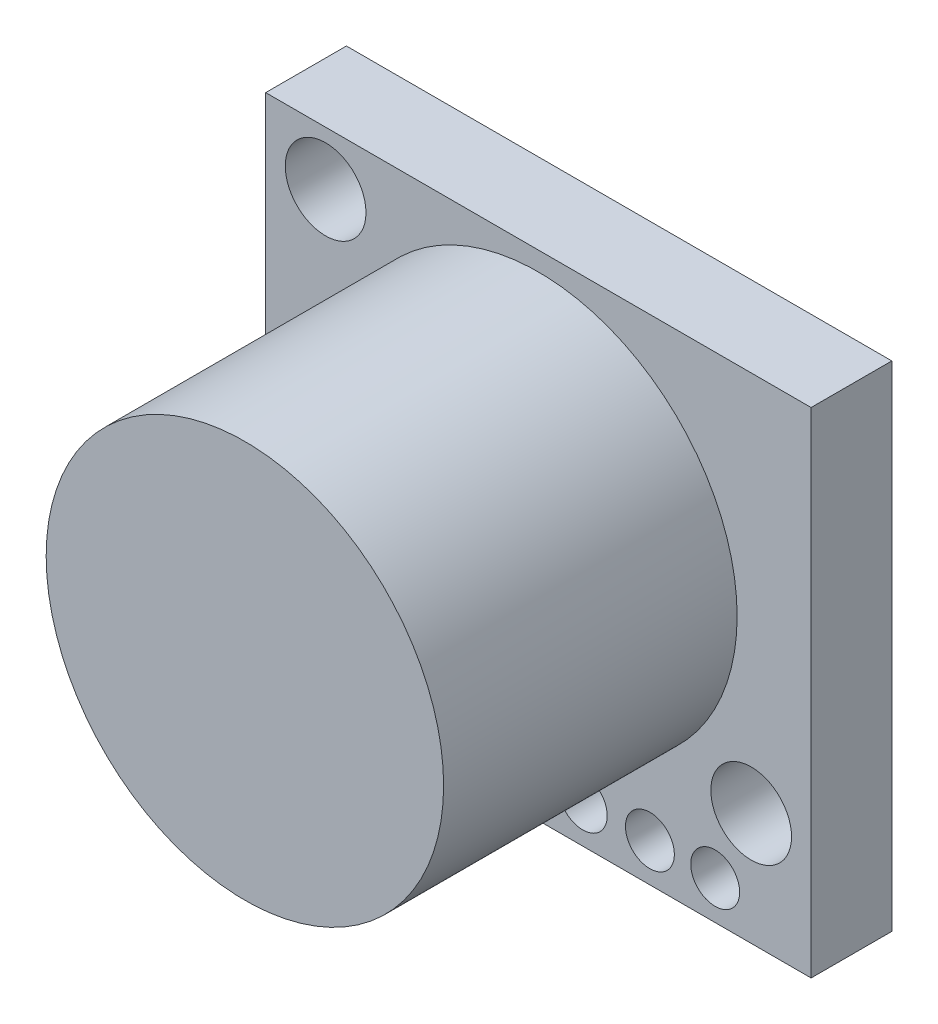
ISO-10303-21;
HEADER;
FILE_DESCRIPTION(('STEP AP214'),'2;1');
FILE_NAME('part.step','',(''),(''),'','','');
FILE_SCHEMA(('AUTOMOTIVE_DESIGN { 1 0 10303 214 1 1 1 1 }'));
ENDSEC;
DATA;
#1=APPLICATION_CONTEXT('core data for automotive mechanical design processes');
#2=APPLICATION_PROTOCOL_DEFINITION('international standard','automotive_design',2000,#1);
#3=PRODUCT_CONTEXT('',#1,'mechanical');
#4=PRODUCT('Part','Part','',(#3));
#5=PRODUCT_RELATED_PRODUCT_CATEGORY('part','',(#4));
#6=PRODUCT_DEFINITION_FORMATION('','',#4);
#7=PRODUCT_DEFINITION_CONTEXT('part definition',#1,'design');
#8=PRODUCT_DEFINITION('design','',#6,#7);
#9=PRODUCT_DEFINITION_SHAPE('','',#8);
#10=(LENGTH_UNIT() NAMED_UNIT(*) SI_UNIT(.MILLI.,.METRE.));
#11=(NAMED_UNIT(*) PLANE_ANGLE_UNIT() SI_UNIT($,.RADIAN.));
#12=(NAMED_UNIT(*) SI_UNIT($,.STERADIAN.) SOLID_ANGLE_UNIT());
#13=UNCERTAINTY_MEASURE_WITH_UNIT(LENGTH_MEASURE(1.E-05),#10,'distance_accuracy_value','');
#14=(GEOMETRIC_REPRESENTATION_CONTEXT(3) GLOBAL_UNCERTAINTY_ASSIGNED_CONTEXT((#13)) GLOBAL_UNIT_ASSIGNED_CONTEXT((#10,
#11,#12)) REPRESENTATION_CONTEXT('',''));
#15=CARTESIAN_POINT('',(0.,0.,0.));
#16=DIRECTION('',(0.,0.,1.));
#17=DIRECTION('',(1.,0.,0.));
#18=AXIS2_PLACEMENT_3D('',#15,#16,#17);
#19=CARTESIAN_POINT('',(0.,0.,3.3));
#20=DIRECTION('',(0.,0.,-1.));
#21=DIRECTION('',(-1.,0.,0.));
#22=AXIS2_PLACEMENT_3D('',#19,#20,#21);
#23=PLANE('',#22);
#24=CARTESIAN_POINT('',(4.35351159437215,1.57430663051988,3.3));
#25=DIRECTION('',(0.,0.,1.));
#26=DIRECTION('',(1.,0.,0.));
#27=AXIS2_PLACEMENT_3D('',#24,#25,#26);
#28=CIRCLE('',#27,1.);
#29=CARTESIAN_POINT('',(5.35351159437215,1.57430663051988,3.3));
#30=VERTEX_POINT('',#29);
#31=EDGE_CURVE('E119',#30,#30,#28,.T.);
#32=ORIENTED_EDGE('',*,*,#31,.F.);
#33=EDGE_LOOP('',(#32));
#34=FACE_BOUND('',#33,.T.);
#35=CARTESIAN_POINT('',(7.38027373877414,1.57430663051988,3.3));
#36=DIRECTION('',(0.,0.,1.));
#37=DIRECTION('',(1.,0.,0.));
#38=AXIS2_PLACEMENT_3D('',#35,#36,#37);
#39=CIRCLE('',#38,1.);
#40=CARTESIAN_POINT('',(8.38027373877414,1.57430663051988,3.3));
#41=VERTEX_POINT('',#40);
#42=EDGE_CURVE('E314',#41,#41,#39,.T.);
#43=ORIENTED_EDGE('',*,*,#42,.F.);
#44=EDGE_LOOP('',(#43));
#45=FACE_BOUND('',#44,.T.);
#46=CARTESIAN_POINT('',(10.2378379993276,1.57430663051988,3.3));
#47=DIRECTION('',(0.,0.,1.));
#48=DIRECTION('',(1.,0.,0.));
#49=AXIS2_PLACEMENT_3D('',#46,#47,#48);
#50=CIRCLE('',#49,1.);
#51=CARTESIAN_POINT('',(11.2378379993276,1.57430663051988,3.3));
#52=VERTEX_POINT('',#51);
#53=EDGE_CURVE('E317',#52,#52,#50,.T.);
#54=ORIENTED_EDGE('',*,*,#53,.F.);
#55=EDGE_LOOP('',(#54));
#56=FACE_BOUND('',#55,.T.);
#57=CARTESIAN_POINT('',(12.9638039057766,1.57430663051988,3.3));
#58=DIRECTION('',(0.,0.,1.));
#59=DIRECTION('',(1.,0.,0.));
#60=AXIS2_PLACEMENT_3D('',#57,#58,#59);
#61=CIRCLE('',#60,1.);
#62=CARTESIAN_POINT('',(13.9638039057766,1.57430663051988,3.3));
#63=VERTEX_POINT('',#62);
#64=EDGE_CURVE('E322',#63,#63,#61,.T.);
#65=ORIENTED_EDGE('',*,*,#64,.F.);
#66=EDGE_LOOP('',(#65));
#67=FACE_BOUND('',#66,.T.);
#68=CARTESIAN_POINT('',(15.7085695770976,1.57430663051988,3.3));
#69=DIRECTION('',(0.,0.,1.));
#70=DIRECTION('',(1.,0.,0.));
#71=AXIS2_PLACEMENT_3D('',#68,#69,#70);
#72=CIRCLE('',#71,1.);
#73=CARTESIAN_POINT('',(16.7085695770976,1.57430663051988,3.3));
#74=VERTEX_POINT('',#73);
#75=EDGE_CURVE('E324',#74,#74,#72,.T.);
#76=ORIENTED_EDGE('',*,*,#75,.F.);
#77=EDGE_LOOP('',(#76));
#78=FACE_BOUND('',#77,.T.);
#79=CARTESIAN_POINT('',(18.3781361889304,1.57430663051988,3.3));
#80=DIRECTION('',(0.,0.,1.));
#81=DIRECTION('',(1.,0.,0.));
#82=AXIS2_PLACEMENT_3D('',#79,#80,#81);
#83=CIRCLE('',#82,1.);
#84=CARTESIAN_POINT('',(19.3781361889304,1.57430663051988,3.3));
#85=VERTEX_POINT('',#84);
#86=EDGE_CURVE('E144',#85,#85,#83,.T.);
#87=ORIENTED_EDGE('',*,*,#86,.F.);
#88=EDGE_LOOP('',(#87));
#89=FACE_BOUND('',#88,.T.);
#90=CARTESIAN_POINT('',(11.15,11.3,3.3));
#91=DIRECTION('',(0.,0.,1.));
#92=DIRECTION('',(1.,0.,0.));
#93=AXIS2_PLACEMENT_3D('',#90,#91,#92);
#94=CIRCLE('',#93,8.12500000000001);
#95=CARTESIAN_POINT('',(19.275,11.3,3.3));
#96=VERTEX_POINT('',#95);
#97=EDGE_CURVE('E11',#96,#96,#94,.T.);
#98=ORIENTED_EDGE('',*,*,#97,.F.);
#99=EDGE_LOOP('',(#98));
#100=FACE_BOUND('',#99,.T.);
#101=DIRECTION('',(0.,-1.,0.));
#102=VECTOR('',#101,1.);
#103=CARTESIAN_POINT('',(0.,0.,3.3));
#104=LINE('',#103,#102);
#105=CARTESIAN_POINT('',(0.,20.2,3.3));
#106=VERTEX_POINT('',#105);
#107=CARTESIAN_POINT('',(0.,0.,3.3));
#108=VERTEX_POINT('',#107);
#109=EDGE_CURVE('E91',#106,#108,#104,.T.);
#110=ORIENTED_EDGE('',*,*,#109,.T.);
#111=DIRECTION('',(1.,0.,0.));
#112=VECTOR('',#111,1.);
#113=CARTESIAN_POINT('',(0.,0.,3.3));
#114=LINE('',#113,#112);
#115=CARTESIAN_POINT('',(22.3,0.,3.3));
#116=VERTEX_POINT('',#115);
#117=EDGE_CURVE('E86',#108,#116,#114,.T.);
#118=ORIENTED_EDGE('',*,*,#117,.T.);
#119=DIRECTION('',(0.,1.,0.));
#120=VECTOR('',#119,1.);
#121=CARTESIAN_POINT('',(22.3,0.,3.3));
#122=LINE('',#121,#120);
#123=CARTESIAN_POINT('',(22.3,20.2,3.3));
#124=VERTEX_POINT('',#123);
#125=EDGE_CURVE('E89',#116,#124,#122,.T.);
#126=ORIENTED_EDGE('',*,*,#125,.T.);
#127=DIRECTION('',(-1.,0.,0.));
#128=VECTOR('',#127,1.);
#129=CARTESIAN_POINT('',(0.,20.2,3.3));
#130=LINE('',#129,#128);
#131=EDGE_CURVE('E55',#124,#106,#130,.T.);
#132=ORIENTED_EDGE('',*,*,#131,.T.);
#133=EDGE_LOOP('',(#110,#118,#126,#132));
#134=FACE_BOUND('',#133,.T.);
#135=CARTESIAN_POINT('',(2.45,18.,3.3));
#136=DIRECTION('',(0.,0.,1.));
#137=DIRECTION('',(1.,0.,0.));
#138=AXIS2_PLACEMENT_3D('',#135,#136,#137);
#139=CIRCLE('',#138,1.65);
#140=CARTESIAN_POINT('',(4.1,18.,3.3));
#141=VERTEX_POINT('',#140);
#142=EDGE_CURVE('E108',#141,#141,#139,.T.);
#143=ORIENTED_EDGE('',*,*,#142,.F.);
#144=EDGE_LOOP('',(#143));
#145=FACE_BOUND('',#144,.T.);
#146=CARTESIAN_POINT('',(19.85,4.6,3.3));
#147=DIRECTION('',(0.,0.,1.));
#148=DIRECTION('',(1.,0.,0.));
#149=AXIS2_PLACEMENT_3D('',#146,#147,#148);
#150=CIRCLE('',#149,1.65);
#151=CARTESIAN_POINT('',(21.5,4.6,3.3));
#152=VERTEX_POINT('',#151);
#153=EDGE_CURVE('E141',#152,#152,#150,.T.);
#154=ORIENTED_EDGE('',*,*,#153,.F.);
#155=EDGE_LOOP('',(#154));
#156=FACE_BOUND('',#155,.T.);
#157=ADVANCED_FACE('F36',(#34,#45,#56,#67,#78,#89,#100,#134,#145,#156),#23,.F.);
#158=CARTESIAN_POINT('',(0.,0.,0.));
#159=DIRECTION('',(0.,0.,-1.));
#160=DIRECTION('',(-1.,0.,0.));
#161=AXIS2_PLACEMENT_3D('',#158,#159,#160);
#162=PLANE('',#161);
#163=CARTESIAN_POINT('',(4.35351159437215,1.57430663051988,0.));
#164=DIRECTION('',(0.,0.,-1.));
#165=DIRECTION('',(-1.,0.,0.));
#166=AXIS2_PLACEMENT_3D('',#163,#164,#165);
#167=CIRCLE('',#166,1.);
#168=CARTESIAN_POINT('',(3.35351159437215,1.57430663051988,0.));
#169=VERTEX_POINT('',#168);
#170=EDGE_CURVE('E40',#169,#169,#167,.T.);
#171=ORIENTED_EDGE('',*,*,#170,.F.);
#172=EDGE_LOOP('',(#171));
#173=FACE_BOUND('',#172,.T.);
#174=CARTESIAN_POINT('',(7.38027373877414,1.57430663051988,0.));
#175=DIRECTION('',(0.,0.,-1.));
#176=DIRECTION('',(-1.,0.,0.));
#177=AXIS2_PLACEMENT_3D('',#174,#175,#176);
#178=CIRCLE('',#177,1.);
#179=CARTESIAN_POINT('',(6.38027373877414,1.57430663051988,0.));
#180=VERTEX_POINT('',#179);
#181=EDGE_CURVE('E127',#180,#180,#178,.T.);
#182=ORIENTED_EDGE('',*,*,#181,.F.);
#183=EDGE_LOOP('',(#182));
#184=FACE_BOUND('',#183,.T.);
#185=CARTESIAN_POINT('',(10.2378379993276,1.57430663051988,0.));
#186=DIRECTION('',(0.,0.,-1.));
#187=DIRECTION('',(-1.,0.,0.));
#188=AXIS2_PLACEMENT_3D('',#185,#186,#187);
#189=CIRCLE('',#188,1.);
#190=CARTESIAN_POINT('',(9.23783799932757,1.57430663051988,0.));
#191=VERTEX_POINT('',#190);
#192=EDGE_CURVE('E125',#191,#191,#189,.T.);
#193=ORIENTED_EDGE('',*,*,#192,.F.);
#194=EDGE_LOOP('',(#193));
#195=FACE_BOUND('',#194,.T.);
#196=CARTESIAN_POINT('',(12.9638039057766,1.57430663051988,0.));
#197=DIRECTION('',(0.,0.,-1.));
#198=DIRECTION('',(-1.,0.,0.));
#199=AXIS2_PLACEMENT_3D('',#196,#197,#198);
#200=CIRCLE('',#199,1.);
#201=CARTESIAN_POINT('',(11.9638039057766,1.57430663051988,0.));
#202=VERTEX_POINT('',#201);
#203=EDGE_CURVE('E122',#202,#202,#200,.T.);
#204=ORIENTED_EDGE('',*,*,#203,.F.);
#205=EDGE_LOOP('',(#204));
#206=FACE_BOUND('',#205,.T.);
#207=CARTESIAN_POINT('',(15.7085695770976,1.57430663051988,0.));
#208=DIRECTION('',(0.,0.,-1.));
#209=DIRECTION('',(-1.,0.,0.));
#210=AXIS2_PLACEMENT_3D('',#207,#208,#209);
#211=CIRCLE('',#210,1.);
#212=CARTESIAN_POINT('',(14.7085695770976,1.57430663051988,0.));
#213=VERTEX_POINT('',#212);
#214=EDGE_CURVE('E118',#213,#213,#211,.T.);
#215=ORIENTED_EDGE('',*,*,#214,.F.);
#216=EDGE_LOOP('',(#215));
#217=FACE_BOUND('',#216,.T.);
#218=CARTESIAN_POINT('',(18.3781361889304,1.57430663051988,0.));
#219=DIRECTION('',(0.,0.,-1.));
#220=DIRECTION('',(-1.,0.,0.));
#221=AXIS2_PLACEMENT_3D('',#218,#219,#220);
#222=CIRCLE('',#221,1.);
#223=CARTESIAN_POINT('',(17.3781361889304,1.57430663051988,0.));
#224=VERTEX_POINT('',#223);
#225=EDGE_CURVE('E115',#224,#224,#222,.T.);
#226=ORIENTED_EDGE('',*,*,#225,.F.);
#227=EDGE_LOOP('',(#226));
#228=FACE_BOUND('',#227,.T.);
#229=CARTESIAN_POINT('',(2.45,18.,0.));
#230=DIRECTION('',(0.,0.,1.));
#231=DIRECTION('',(1.,0.,0.));
#232=AXIS2_PLACEMENT_3D('',#229,#230,#231);
#233=CIRCLE('',#232,1.65);
#234=CARTESIAN_POINT('',(4.1,18.,0.));
#235=VERTEX_POINT('',#234);
#236=EDGE_CURVE('E148',#235,#235,#233,.T.);
#237=ORIENTED_EDGE('',*,*,#236,.T.);
#238=EDGE_LOOP('',(#237));
#239=FACE_BOUND('',#238,.T.);
#240=DIRECTION('',(0.,-1.,0.));
#241=VECTOR('',#240,1.);
#242=CARTESIAN_POINT('',(0.,0.,0.));
#243=LINE('',#242,#241);
#244=CARTESIAN_POINT('',(0.,20.2,0.));
#245=VERTEX_POINT('',#244);
#246=CARTESIAN_POINT('',(0.,0.,0.));
#247=VERTEX_POINT('',#246);
#248=EDGE_CURVE('E105',#245,#247,#243,.T.);
#249=ORIENTED_EDGE('',*,*,#248,.F.);
#250=DIRECTION('',(-1.,0.,0.));
#251=VECTOR('',#250,1.);
#252=CARTESIAN_POINT('',(0.,20.2,0.));
#253=LINE('',#252,#251);
#254=CARTESIAN_POINT('',(22.3,20.2,0.));
#255=VERTEX_POINT('',#254);
#256=EDGE_CURVE('E78',#255,#245,#253,.T.);
#257=ORIENTED_EDGE('',*,*,#256,.F.);
#258=DIRECTION('',(0.,1.,0.));
#259=VECTOR('',#258,1.);
#260=CARTESIAN_POINT('',(22.3,0.,0.));
#261=LINE('',#260,#259);
#262=CARTESIAN_POINT('',(22.3,0.,0.));
#263=VERTEX_POINT('',#262);
#264=EDGE_CURVE('E72',#263,#255,#261,.T.);
#265=ORIENTED_EDGE('',*,*,#264,.F.);
#266=DIRECTION('',(1.,0.,0.));
#267=VECTOR('',#266,1.);
#268=CARTESIAN_POINT('',(0.,0.,0.));
#269=LINE('',#268,#267);
#270=EDGE_CURVE('E96',#247,#263,#269,.T.);
#271=ORIENTED_EDGE('',*,*,#270,.F.);
#272=EDGE_LOOP('',(#249,#257,#265,#271));
#273=FACE_BOUND('',#272,.T.);
#274=CARTESIAN_POINT('',(19.85,4.6,0.));
#275=DIRECTION('',(0.,0.,1.));
#276=DIRECTION('',(1.,0.,0.));
#277=AXIS2_PLACEMENT_3D('',#274,#275,#276);
#278=CIRCLE('',#277,1.65);
#279=CARTESIAN_POINT('',(21.5,4.6,0.));
#280=VERTEX_POINT('',#279);
#281=EDGE_CURVE('E136',#280,#280,#278,.T.);
#282=ORIENTED_EDGE('',*,*,#281,.T.);
#283=EDGE_LOOP('',(#282));
#284=FACE_BOUND('',#283,.T.);
#285=ADVANCED_FACE('F155',(#173,#184,#195,#206,#217,#228,#239,#273,#284),#162,.T.);
#286=CARTESIAN_POINT('',(0.,0.,3.3));
#287=DIRECTION('',(1.,0.,0.));
#288=DIRECTION('',(0.,0.,-1.));
#289=AXIS2_PLACEMENT_3D('',#286,#287,#288);
#290=PLANE('',#289);
#291=ORIENTED_EDGE('',*,*,#248,.T.);
#292=DIRECTION('',(0.,0.,-1.));
#293=VECTOR('',#292,1.);
#294=CARTESIAN_POINT('',(0.,0.,3.3));
#295=LINE('',#294,#293);
#296=EDGE_CURVE('E46',#108,#247,#295,.T.);
#297=ORIENTED_EDGE('',*,*,#296,.F.);
#298=ORIENTED_EDGE('',*,*,#109,.F.);
#299=DIRECTION('',(0.,0.,-1.));
#300=VECTOR('',#299,1.);
#301=CARTESIAN_POINT('',(0.,20.2,3.3));
#302=LINE('',#301,#300);
#303=EDGE_CURVE('E101',#106,#245,#302,.T.);
#304=ORIENTED_EDGE('',*,*,#303,.T.);
#305=EDGE_LOOP('',(#291,#297,#298,#304));
#306=FACE_BOUND('',#305,.T.);
#307=ADVANCED_FACE('F38',(#306),#290,.F.);
#308=CARTESIAN_POINT('',(0.,0.,3.3));
#309=DIRECTION('',(0.,1.,0.));
#310=DIRECTION('',(0.,0.,1.));
#311=AXIS2_PLACEMENT_3D('',#308,#309,#310);
#312=PLANE('',#311);
#313=ORIENTED_EDGE('',*,*,#270,.T.);
#314=DIRECTION('',(0.,0.,-1.));
#315=VECTOR('',#314,1.);
#316=CARTESIAN_POINT('',(22.3,0.,3.3));
#317=LINE('',#316,#315);
#318=EDGE_CURVE('E94',#116,#263,#317,.T.);
#319=ORIENTED_EDGE('',*,*,#318,.F.);
#320=ORIENTED_EDGE('',*,*,#117,.F.);
#321=ORIENTED_EDGE('',*,*,#296,.T.);
#322=EDGE_LOOP('',(#313,#319,#320,#321));
#323=FACE_BOUND('',#322,.T.);
#324=ADVANCED_FACE('F95',(#323),#312,.F.);
#325=CARTESIAN_POINT('',(22.3,0.,3.3));
#326=DIRECTION('',(-1.,0.,0.));
#327=DIRECTION('',(0.,0.,1.));
#328=AXIS2_PLACEMENT_3D('',#325,#326,#327);
#329=PLANE('',#328);
#330=ORIENTED_EDGE('',*,*,#264,.T.);
#331=DIRECTION('',(0.,0.,-1.));
#332=VECTOR('',#331,1.);
#333=CARTESIAN_POINT('',(22.3,20.2,3.3));
#334=LINE('',#333,#332);
#335=EDGE_CURVE('E97',#124,#255,#334,.T.);
#336=ORIENTED_EDGE('',*,*,#335,.F.);
#337=ORIENTED_EDGE('',*,*,#125,.F.);
#338=ORIENTED_EDGE('',*,*,#318,.T.);
#339=EDGE_LOOP('',(#330,#336,#337,#338));
#340=FACE_BOUND('',#339,.T.);
#341=ADVANCED_FACE('F99',(#340),#329,.F.);
#342=CARTESIAN_POINT('',(0.,20.2,3.3));
#343=DIRECTION('',(0.,-1.,0.));
#344=DIRECTION('',(0.,0.,-1.));
#345=AXIS2_PLACEMENT_3D('',#342,#343,#344);
#346=PLANE('',#345);
#347=ORIENTED_EDGE('',*,*,#256,.T.);
#348=ORIENTED_EDGE('',*,*,#303,.F.);
#349=ORIENTED_EDGE('',*,*,#131,.F.);
#350=ORIENTED_EDGE('',*,*,#335,.T.);
#351=EDGE_LOOP('',(#347,#348,#349,#350));
#352=FACE_BOUND('',#351,.T.);
#353=ADVANCED_FACE('F161',(#352),#346,.F.);
#354=CARTESIAN_POINT('',(2.45,18.,3.3));
#355=DIRECTION('',(0.,0.,-1.));
#356=DIRECTION('',(-1.,0.,0.));
#357=AXIS2_PLACEMENT_3D('',#354,#355,#356);
#358=CYLINDRICAL_SURFACE('',#357,1.65);
#359=ORIENTED_EDGE('',*,*,#142,.T.);
#360=EDGE_LOOP('',(#359));
#361=FACE_BOUND('',#360,.T.);
#362=ORIENTED_EDGE('',*,*,#236,.F.);
#363=EDGE_LOOP('',(#362));
#364=FACE_BOUND('',#363,.T.);
#365=ADVANCED_FACE('F158',(#361,#364),#358,.F.);
#366=CARTESIAN_POINT('',(19.85,4.6,3.3));
#367=DIRECTION('',(0.,0.,-1.));
#368=DIRECTION('',(-1.,0.,0.));
#369=AXIS2_PLACEMENT_3D('',#366,#367,#368);
#370=CYLINDRICAL_SURFACE('',#369,1.65);
#371=ORIENTED_EDGE('',*,*,#153,.T.);
#372=EDGE_LOOP('',(#371));
#373=FACE_BOUND('',#372,.T.);
#374=ORIENTED_EDGE('',*,*,#281,.F.);
#375=EDGE_LOOP('',(#374));
#376=FACE_BOUND('',#375,.T.);
#377=ADVANCED_FACE('F160',(#373,#376),#370,.F.);
#378=CARTESIAN_POINT('',(11.15,11.3,15.3));
#379=DIRECTION('',(0.,0.,-1.));
#380=DIRECTION('',(-1.,0.,0.));
#381=AXIS2_PLACEMENT_3D('',#378,#379,#380);
#382=CYLINDRICAL_SURFACE('',#381,8.12500000000001);
#383=CARTESIAN_POINT('',(11.15,11.3,15.3));
#384=DIRECTION('',(0.,0.,1.));
#385=DIRECTION('',(1.,0.,0.));
#386=AXIS2_PLACEMENT_3D('',#383,#384,#385);
#387=CIRCLE('',#386,8.12500000000001);
#388=CARTESIAN_POINT('',(19.275,11.3,15.3));
#389=VERTEX_POINT('',#388);
#390=EDGE_CURVE('E132',#389,#389,#387,.T.);
#391=ORIENTED_EDGE('',*,*,#390,.F.);
#392=EDGE_LOOP('',(#391));
#393=FACE_BOUND('',#392,.T.);
#394=ORIENTED_EDGE('',*,*,#97,.T.);
#395=EDGE_LOOP('',(#394));
#396=FACE_BOUND('',#395,.T.);
#397=ADVANCED_FACE('F168',(#393,#396),#382,.T.);
#398=CARTESIAN_POINT('',(0.,0.,15.3));
#399=DIRECTION('',(0.,0.,1.));
#400=DIRECTION('',(1.,0.,0.));
#401=AXIS2_PLACEMENT_3D('',#398,#399,#400);
#402=PLANE('',#401);
#403=ORIENTED_EDGE('',*,*,#390,.T.);
#404=EDGE_LOOP('',(#403));
#405=FACE_BOUND('',#404,.T.);
#406=ADVANCED_FACE('F213',(#405),#402,.T.);
#407=CARTESIAN_POINT('',(18.3781361889304,1.57430663051988,-8.7));
#408=DIRECTION('',(0.,0.,1.));
#409=DIRECTION('',(1.,0.,0.));
#410=AXIS2_PLACEMENT_3D('',#407,#408,#409);
#411=CYLINDRICAL_SURFACE('',#410,1.);
#412=ORIENTED_EDGE('',*,*,#225,.T.);
#413=EDGE_LOOP('',(#412));
#414=FACE_BOUND('',#413,.T.);
#415=ORIENTED_EDGE('',*,*,#86,.T.);
#416=EDGE_LOOP('',(#415));
#417=FACE_BOUND('',#416,.T.);
#418=ADVANCED_FACE('F207',(#414,#417),#411,.F.);
#419=CARTESIAN_POINT('',(15.7085695770976,1.57430663051988,-8.7));
#420=DIRECTION('',(0.,0.,1.));
#421=DIRECTION('',(1.,0.,0.));
#422=AXIS2_PLACEMENT_3D('',#419,#420,#421);
#423=CYLINDRICAL_SURFACE('',#422,1.);
#424=ORIENTED_EDGE('',*,*,#214,.T.);
#425=EDGE_LOOP('',(#424));
#426=FACE_BOUND('',#425,.T.);
#427=ORIENTED_EDGE('',*,*,#75,.T.);
#428=EDGE_LOOP('',(#427));
#429=FACE_BOUND('',#428,.T.);
#430=ADVANCED_FACE('F212',(#426,#429),#423,.F.);
#431=CARTESIAN_POINT('',(12.9638039057766,1.57430663051988,-8.7));
#432=DIRECTION('',(0.,0.,1.));
#433=DIRECTION('',(1.,0.,0.));
#434=AXIS2_PLACEMENT_3D('',#431,#432,#433);
#435=CYLINDRICAL_SURFACE('',#434,1.);
#436=ORIENTED_EDGE('',*,*,#203,.T.);
#437=EDGE_LOOP('',(#436));
#438=FACE_BOUND('',#437,.T.);
#439=ORIENTED_EDGE('',*,*,#64,.T.);
#440=EDGE_LOOP('',(#439));
#441=FACE_BOUND('',#440,.T.);
#442=ADVANCED_FACE('F225',(#438,#441),#435,.F.);
#443=CARTESIAN_POINT('',(10.2378379993276,1.57430663051988,-8.7));
#444=DIRECTION('',(0.,0.,1.));
#445=DIRECTION('',(1.,0.,0.));
#446=AXIS2_PLACEMENT_3D('',#443,#444,#445);
#447=CYLINDRICAL_SURFACE('',#446,1.);
#448=ORIENTED_EDGE('',*,*,#192,.T.);
#449=EDGE_LOOP('',(#448));
#450=FACE_BOUND('',#449,.T.);
#451=ORIENTED_EDGE('',*,*,#53,.T.);
#452=EDGE_LOOP('',(#451));
#453=FACE_BOUND('',#452,.T.);
#454=ADVANCED_FACE('F235',(#450,#453),#447,.F.);
#455=CARTESIAN_POINT('',(7.38027373877414,1.57430663051988,-8.7));
#456=DIRECTION('',(0.,0.,1.));
#457=DIRECTION('',(1.,0.,0.));
#458=AXIS2_PLACEMENT_3D('',#455,#456,#457);
#459=CYLINDRICAL_SURFACE('',#458,1.);
#460=ORIENTED_EDGE('',*,*,#181,.T.);
#461=EDGE_LOOP('',(#460));
#462=FACE_BOUND('',#461,.T.);
#463=ORIENTED_EDGE('',*,*,#42,.T.);
#464=EDGE_LOOP('',(#463));
#465=FACE_BOUND('',#464,.T.);
#466=ADVANCED_FACE('F245',(#462,#465),#459,.F.);
#467=CARTESIAN_POINT('',(4.35351159437215,1.57430663051988,-8.7));
#468=DIRECTION('',(0.,0.,1.));
#469=DIRECTION('',(1.,0.,0.));
#470=AXIS2_PLACEMENT_3D('',#467,#468,#469);
#471=CYLINDRICAL_SURFACE('',#470,1.);
#472=ORIENTED_EDGE('',*,*,#170,.T.);
#473=EDGE_LOOP('',(#472));
#474=FACE_BOUND('',#473,.T.);
#475=ORIENTED_EDGE('',*,*,#31,.T.);
#476=EDGE_LOOP('',(#475));
#477=FACE_BOUND('',#476,.T.);
#478=ADVANCED_FACE('F255',(#474,#477),#471,.F.);
#479=CLOSED_SHELL('',(#157,#285,#307,#324,#341,#353,#365,#377,#397,#406,#418,#430,#442,#454,
#466,#478));
#480=MANIFOLD_SOLID_BREP('B2',#479);
#481=ADVANCED_BREP_SHAPE_REPRESENTATION('',(#18,#480),#14);
#482=SHAPE_DEFINITION_REPRESENTATION(#9,#481);
ENDSEC;
END-ISO-10303-21;
